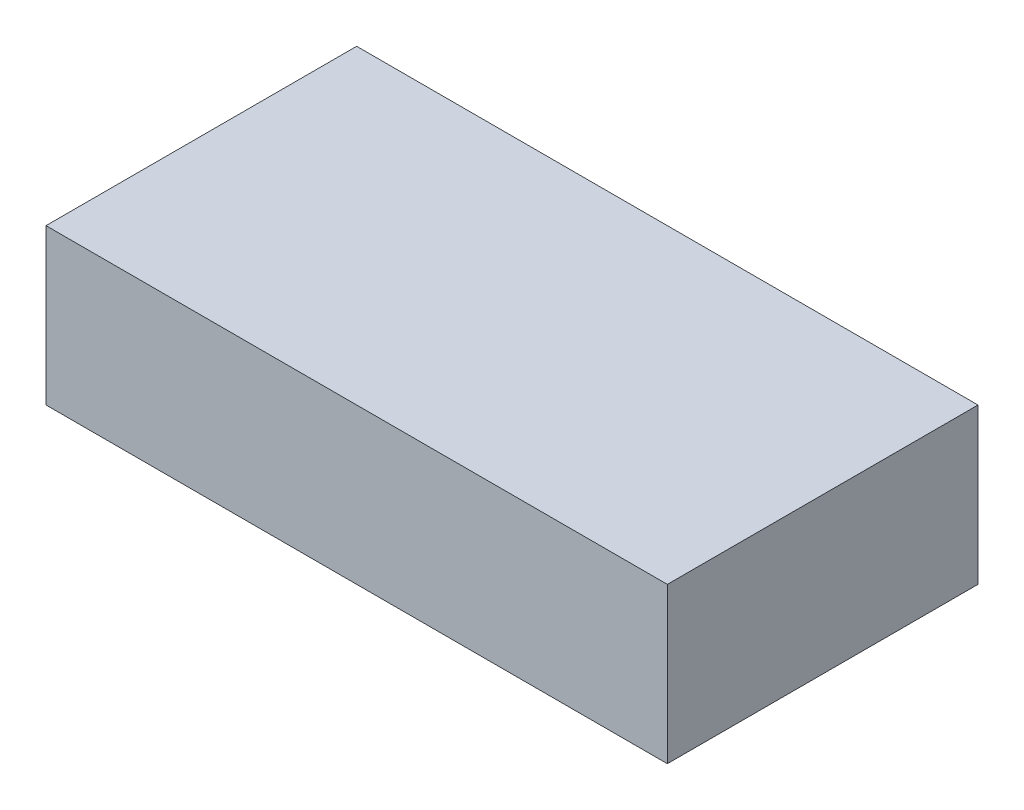
ISO-10303-21;
HEADER;
FILE_DESCRIPTION(('STEP AP214'),'2;1');
FILE_NAME('part.step','',(''),(''),'','','');
FILE_SCHEMA(('AUTOMOTIVE_DESIGN { 1 0 10303 214 1 1 1 1 }'));
ENDSEC;
DATA;
#1=APPLICATION_CONTEXT('core data for automotive mechanical design processes');
#2=APPLICATION_PROTOCOL_DEFINITION('international standard','automotive_design',2000,#1);
#3=PRODUCT_CONTEXT('',#1,'mechanical');
#4=PRODUCT('Part','Part','',(#3));
#5=PRODUCT_RELATED_PRODUCT_CATEGORY('part','',(#4));
#6=PRODUCT_DEFINITION_FORMATION('','',#4);
#7=PRODUCT_DEFINITION_CONTEXT('part definition',#1,'design');
#8=PRODUCT_DEFINITION('design','',#6,#7);
#9=PRODUCT_DEFINITION_SHAPE('','',#8);
#10=(LENGTH_UNIT() NAMED_UNIT(*) SI_UNIT(.MILLI.,.METRE.));
#11=(NAMED_UNIT(*) PLANE_ANGLE_UNIT() SI_UNIT($,.RADIAN.));
#12=(NAMED_UNIT(*) SI_UNIT($,.STERADIAN.) SOLID_ANGLE_UNIT());
#13=UNCERTAINTY_MEASURE_WITH_UNIT(LENGTH_MEASURE(1.E-05),#10,'distance_accuracy_value','');
#14=(GEOMETRIC_REPRESENTATION_CONTEXT(3) GLOBAL_UNCERTAINTY_ASSIGNED_CONTEXT((#13)) GLOBAL_UNIT_ASSIGNED_CONTEXT((#10,
#11,#12)) REPRESENTATION_CONTEXT('',''));
#15=CARTESIAN_POINT('',(0.,0.,0.));
#16=DIRECTION('',(0.,0.,1.));
#17=DIRECTION('',(1.,0.,0.));
#18=AXIS2_PLACEMENT_3D('',#15,#16,#17);
#19=CARTESIAN_POINT('',(100.,25.,-50.));
#20=DIRECTION('',(-1.,0.,0.));
#21=DIRECTION('',(0.,0.,1.));
#22=AXIS2_PLACEMENT_3D('',#19,#20,#21);
#23=PLANE('',#22);
#24=DIRECTION('',(0.,0.,-1.));
#25=VECTOR('',#24,1.);
#26=CARTESIAN_POINT('',(100.,-25.,-50.));
#27=LINE('',#26,#25);
#28=CARTESIAN_POINT('',(100.,-25.,50.));
#29=VERTEX_POINT('',#28);
#30=CARTESIAN_POINT('',(100.,-25.,-50.));
#31=VERTEX_POINT('',#30);
#32=EDGE_CURVE('E97',#29,#31,#27,.T.);
#33=ORIENTED_EDGE('',*,*,#32,.T.);
#34=DIRECTION('',(0.,-1.,0.));
#35=VECTOR('',#34,1.);
#36=CARTESIAN_POINT('',(100.,25.,-50.));
#37=LINE('',#36,#35);
#38=CARTESIAN_POINT('',(100.,25.,-50.));
#39=VERTEX_POINT('',#38);
#40=EDGE_CURVE('E11',#39,#31,#37,.T.);
#41=ORIENTED_EDGE('',*,*,#40,.F.);
#42=DIRECTION('',(0.,0.,-1.));
#43=VECTOR('',#42,1.);
#44=CARTESIAN_POINT('',(100.,25.,-50.));
#45=LINE('',#44,#43);
#46=CARTESIAN_POINT('',(100.,25.,50.));
#47=VERTEX_POINT('',#46);
#48=EDGE_CURVE('E85',#47,#39,#45,.T.);
#49=ORIENTED_EDGE('',*,*,#48,.F.);
#50=DIRECTION('',(0.,-1.,0.));
#51=VECTOR('',#50,1.);
#52=CARTESIAN_POINT('',(100.,25.,50.));
#53=LINE('',#52,#51);
#54=EDGE_CURVE('E93',#47,#29,#53,.T.);
#55=ORIENTED_EDGE('',*,*,#54,.T.);
#56=EDGE_LOOP('',(#33,#41,#49,#55));
#57=FACE_BOUND('',#56,.T.);
#58=ADVANCED_FACE('F34',(#57),#23,.F.);
#59=CARTESIAN_POINT('',(-100.,25.,-50.));
#60=DIRECTION('',(0.,0.,1.));
#61=DIRECTION('',(1.,0.,0.));
#62=AXIS2_PLACEMENT_3D('',#59,#60,#61);
#63=PLANE('',#62);
#64=DIRECTION('',(-1.,0.,0.));
#65=VECTOR('',#64,1.);
#66=CARTESIAN_POINT('',(-100.,-25.,-50.));
#67=LINE('',#66,#65);
#68=CARTESIAN_POINT('',(-100.,-25.,-50.));
#69=VERTEX_POINT('',#68);
#70=EDGE_CURVE('E89',#31,#69,#67,.T.);
#71=ORIENTED_EDGE('',*,*,#70,.T.);
#72=DIRECTION('',(0.,-1.,0.));
#73=VECTOR('',#72,1.);
#74=CARTESIAN_POINT('',(-100.,25.,-50.));
#75=LINE('',#74,#73);
#76=CARTESIAN_POINT('',(-100.,25.,-50.));
#77=VERTEX_POINT('',#76);
#78=EDGE_CURVE('E42',#77,#69,#75,.T.);
#79=ORIENTED_EDGE('',*,*,#78,.F.);
#80=DIRECTION('',(-1.,0.,0.));
#81=VECTOR('',#80,1.);
#82=CARTESIAN_POINT('',(-100.,25.,-50.));
#83=LINE('',#82,#81);
#84=EDGE_CURVE('E80',#39,#77,#83,.T.);
#85=ORIENTED_EDGE('',*,*,#84,.F.);
#86=ORIENTED_EDGE('',*,*,#40,.T.);
#87=EDGE_LOOP('',(#71,#79,#85,#86));
#88=FACE_BOUND('',#87,.T.);
#89=ADVANCED_FACE('F88',(#88),#63,.F.);
#90=CARTESIAN_POINT('',(-100.,25.,-50.));
#91=DIRECTION('',(1.,0.,0.));
#92=DIRECTION('',(0.,0.,-1.));
#93=AXIS2_PLACEMENT_3D('',#90,#91,#92);
#94=PLANE('',#93);
#95=DIRECTION('',(0.,0.,1.));
#96=VECTOR('',#95,1.);
#97=CARTESIAN_POINT('',(-100.,-25.,-50.));
#98=LINE('',#97,#96);
#99=CARTESIAN_POINT('',(-100.,-25.,50.));
#100=VERTEX_POINT('',#99);
#101=EDGE_CURVE('E67',#69,#100,#98,.T.);
#102=ORIENTED_EDGE('',*,*,#101,.T.);
#103=DIRECTION('',(0.,-1.,0.));
#104=VECTOR('',#103,1.);
#105=CARTESIAN_POINT('',(-100.,25.,50.));
#106=LINE('',#105,#104);
#107=CARTESIAN_POINT('',(-100.,25.,50.));
#108=VERTEX_POINT('',#107);
#109=EDGE_CURVE('E90',#108,#100,#106,.T.);
#110=ORIENTED_EDGE('',*,*,#109,.F.);
#111=DIRECTION('',(0.,0.,1.));
#112=VECTOR('',#111,1.);
#113=CARTESIAN_POINT('',(-100.,25.,-50.));
#114=LINE('',#113,#112);
#115=EDGE_CURVE('E83',#77,#108,#114,.T.);
#116=ORIENTED_EDGE('',*,*,#115,.F.);
#117=ORIENTED_EDGE('',*,*,#78,.T.);
#118=EDGE_LOOP('',(#102,#110,#116,#117));
#119=FACE_BOUND('',#118,.T.);
#120=ADVANCED_FACE('F91',(#119),#94,.F.);
#121=CARTESIAN_POINT('',(-100.,25.,50.));
#122=DIRECTION('',(0.,0.,-1.));
#123=DIRECTION('',(-1.,0.,0.));
#124=AXIS2_PLACEMENT_3D('',#121,#122,#123);
#125=PLANE('',#124);
#126=DIRECTION('',(1.,0.,0.));
#127=VECTOR('',#126,1.);
#128=CARTESIAN_POINT('',(-100.,-25.,50.));
#129=LINE('',#128,#127);
#130=EDGE_CURVE('E73',#100,#29,#129,.T.);
#131=ORIENTED_EDGE('',*,*,#130,.T.);
#132=ORIENTED_EDGE('',*,*,#54,.F.);
#133=DIRECTION('',(1.,0.,0.));
#134=VECTOR('',#133,1.);
#135=CARTESIAN_POINT('',(-100.,25.,50.));
#136=LINE('',#135,#134);
#137=EDGE_CURVE('E50',#108,#47,#136,.T.);
#138=ORIENTED_EDGE('',*,*,#137,.F.);
#139=ORIENTED_EDGE('',*,*,#109,.T.);
#140=EDGE_LOOP('',(#131,#132,#138,#139));
#141=FACE_BOUND('',#140,.T.);
#142=ADVANCED_FACE('F104',(#141),#125,.F.);
#143=CARTESIAN_POINT('',(0.,25.,0.));
#144=DIRECTION('',(0.,1.,0.));
#145=DIRECTION('',(0.,0.,1.));
#146=AXIS2_PLACEMENT_3D('',#143,#144,#145);
#147=PLANE('',#146);
#148=ORIENTED_EDGE('',*,*,#48,.T.);
#149=ORIENTED_EDGE('',*,*,#84,.T.);
#150=ORIENTED_EDGE('',*,*,#115,.T.);
#151=ORIENTED_EDGE('',*,*,#137,.T.);
#152=EDGE_LOOP('',(#148,#149,#150,#151));
#153=FACE_BOUND('',#152,.T.);
#154=ADVANCED_FACE('F81',(#153),#147,.T.);
#155=CARTESIAN_POINT('',(0.,-25.,0.));
#156=DIRECTION('',(0.,1.,0.));
#157=DIRECTION('',(0.,0.,1.));
#158=AXIS2_PLACEMENT_3D('',#155,#156,#157);
#159=PLANE('',#158);
#160=ORIENTED_EDGE('',*,*,#32,.F.);
#161=ORIENTED_EDGE('',*,*,#130,.F.);
#162=ORIENTED_EDGE('',*,*,#101,.F.);
#163=ORIENTED_EDGE('',*,*,#70,.F.);
#164=EDGE_LOOP('',(#160,#161,#162,#163));
#165=FACE_BOUND('',#164,.T.);
#166=ADVANCED_FACE('F107',(#165),#159,.F.);
#167=CLOSED_SHELL('',(#58,#89,#120,#142,#154,#166));
#168=MANIFOLD_SOLID_BREP('B2',#167);
#169=ADVANCED_BREP_SHAPE_REPRESENTATION('',(#18,#168),#14);
#170=SHAPE_DEFINITION_REPRESENTATION(#9,#169);
ENDSEC;
END-ISO-10303-21;
